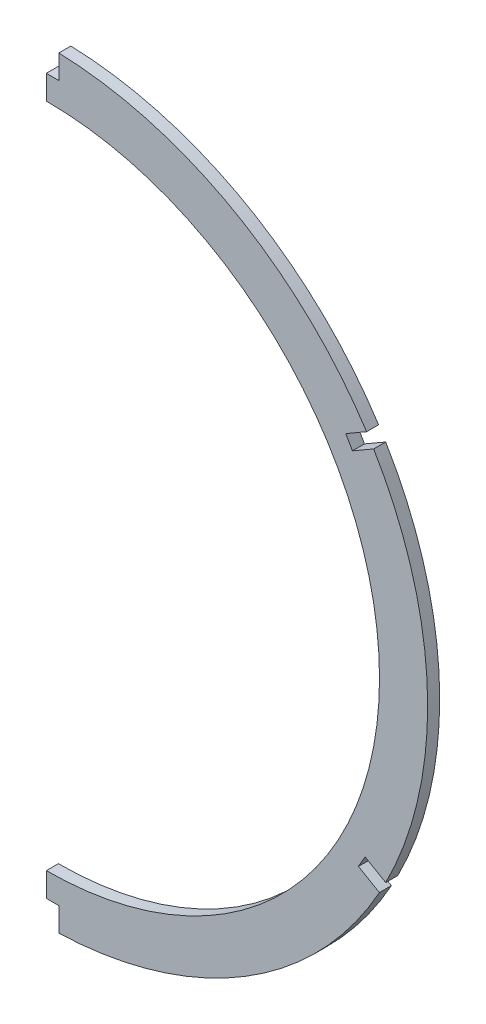
ISO-10303-21;
HEADER;
FILE_DESCRIPTION(('STEP AP214'),'2;1');
FILE_NAME('part.step','',(''),(''),'','','');
FILE_SCHEMA(('AUTOMOTIVE_DESIGN { 1 0 10303 214 1 1 1 1 }'));
ENDSEC;
DATA;
#1=APPLICATION_CONTEXT('core data for automotive mechanical design processes');
#2=APPLICATION_PROTOCOL_DEFINITION('international standard','automotive_design',2000,#1);
#3=PRODUCT_CONTEXT('',#1,'mechanical');
#4=PRODUCT('Part','Part','',(#3));
#5=PRODUCT_RELATED_PRODUCT_CATEGORY('part','',(#4));
#6=PRODUCT_DEFINITION_FORMATION('','',#4);
#7=PRODUCT_DEFINITION_CONTEXT('part definition',#1,'design');
#8=PRODUCT_DEFINITION('design','',#6,#7);
#9=PRODUCT_DEFINITION_SHAPE('','',#8);
#10=(LENGTH_UNIT() NAMED_UNIT(*) SI_UNIT(.MILLI.,.METRE.));
#11=(NAMED_UNIT(*) PLANE_ANGLE_UNIT() SI_UNIT($,.RADIAN.));
#12=(NAMED_UNIT(*) SI_UNIT($,.STERADIAN.) SOLID_ANGLE_UNIT());
#13=UNCERTAINTY_MEASURE_WITH_UNIT(LENGTH_MEASURE(1.E-05),#10,'distance_accuracy_value','');
#14=(GEOMETRIC_REPRESENTATION_CONTEXT(3) GLOBAL_UNCERTAINTY_ASSIGNED_CONTEXT((#13)) GLOBAL_UNIT_ASSIGNED_CONTEXT((#10,
#11,#12)) REPRESENTATION_CONTEXT('',''));
#15=CARTESIAN_POINT('',(0.,0.,0.));
#16=DIRECTION('',(0.,0.,1.));
#17=DIRECTION('',(1.,0.,0.));
#18=AXIS2_PLACEMENT_3D('',#15,#16,#17);
#19=CARTESIAN_POINT('',(0.,6.07817424837746,-3.175));
#20=DIRECTION('',(0.,0.,1.));
#21=DIRECTION('',(1.,0.,0.));
#22=AXIS2_PLACEMENT_3D('',#19,#20,#21);
#23=CYLINDRICAL_SURFACE('',#22,100.601825751622);
#24=CARTESIAN_POINT('',(0.,6.07817424837746,-3.175));
#25=DIRECTION('',(0.,0.,1.));
#26=DIRECTION('',(1.,0.,0.));
#27=AXIS2_PLACEMENT_3D('',#24,#25,#26);
#28=CIRCLE('',#27,100.601825751622);
#29=CARTESIAN_POINT('',(84.490367240827,60.6868291308226,-3.175));
#30=VERTEX_POINT('',#29);
#31=CARTESIAN_POINT('',(3.302,106.625795505968,-3.175));
#32=VERTEX_POINT('',#31);
#33=EDGE_CURVE('E255',#30,#32,#28,.T.);
#34=ORIENTED_EDGE('',*,*,#33,.T.);
#35=DIRECTION('',(0.,0.,1.));
#36=VECTOR('',#35,1.);
#37=CARTESIAN_POINT('',(3.302,106.625795505968,-3.175));
#38=LINE('',#37,#36);
#39=CARTESIAN_POINT('',(3.302,106.625795505968,0.));
#40=VERTEX_POINT('',#39);
#41=EDGE_CURVE('E154',#32,#40,#38,.T.);
#42=ORIENTED_EDGE('',*,*,#41,.T.);
#43=CARTESIAN_POINT('',(0.,6.07817424837746,0.));
#44=DIRECTION('',(0.,0.,1.));
#45=DIRECTION('',(1.,0.,0.));
#46=AXIS2_PLACEMENT_3D('',#43,#44,#45);
#47=CIRCLE('',#46,100.601825751622);
#48=CARTESIAN_POINT('',(84.490367240827,60.6868291308226,0.));
#49=VERTEX_POINT('',#48);
#50=EDGE_CURVE('E251',#49,#40,#47,.T.);
#51=ORIENTED_EDGE('',*,*,#50,.F.);
#52=DIRECTION('',(0.,0.,1.));
#53=VECTOR('',#52,1.);
#54=CARTESIAN_POINT('',(84.490367240827,60.6868291308226,-3.175));
#55=LINE('',#54,#53);
#56=EDGE_CURVE('E58',#30,#49,#55,.T.);
#57=ORIENTED_EDGE('',*,*,#56,.F.);
#58=EDGE_LOOP('',(#34,#42,#51,#57));
#59=FACE_BOUND('',#58,.T.);
#60=ADVANCED_FACE('F36',(#59),#23,.T.);
#61=CARTESIAN_POINT('',(3.30199999999999,-94.4694470092128,-3.175));
#62=VERTEX_POINT('',#61);
#63=CARTESIAN_POINT('',(87.8721842645062,-42.903522099794,-3.175));
#64=VERTEX_POINT('',#63);
#65=EDGE_CURVE('E259',#62,#64,#28,.T.);
#66=ORIENTED_EDGE('',*,*,#65,.T.);
#67=DIRECTION('',(0.,0.,1.));
#68=VECTOR('',#67,1.);
#69=CARTESIAN_POINT('',(87.8721842645062,-42.903522099794,-3.175));
#70=LINE('',#69,#68);
#71=CARTESIAN_POINT('',(87.8721842645062,-42.903522099794,0.));
#72=VERTEX_POINT('',#71);
#73=EDGE_CURVE('E198',#64,#72,#70,.T.);
#74=ORIENTED_EDGE('',*,*,#73,.T.);
#75=CARTESIAN_POINT('',(3.30199999999999,-94.4694470092128,0.));
#76=VERTEX_POINT('',#75);
#77=EDGE_CURVE('E258',#76,#72,#47,.T.);
#78=ORIENTED_EDGE('',*,*,#77,.F.);
#79=DIRECTION('',(0.,0.,1.));
#80=VECTOR('',#79,1.);
#81=CARTESIAN_POINT('',(3.30199999999999,-94.4694470092128,-3.175));
#82=LINE('',#81,#80);
#83=EDGE_CURVE('E192',#62,#76,#82,.T.);
#84=ORIENTED_EDGE('',*,*,#83,.F.);
#85=EDGE_LOOP('',(#66,#74,#78,#84));
#86=FACE_BOUND('',#85,.T.);
#87=ADVANCED_FACE('F294',(#86),#23,.T.);
#88=DIRECTION('',(0.,0.,1.));
#89=VECTOR('',#88,1.);
#90=CARTESIAN_POINT('',(89.5376660151082,-39.7883027160326,-3.175));
#91=LINE('',#90,#89);
#92=CARTESIAN_POINT('',(89.5376660151082,-39.7883027160326,-3.175));
#93=VERTEX_POINT('',#92);
#94=CARTESIAN_POINT('',(89.5376660151082,-39.7883027160326,0.));
#95=VERTEX_POINT('',#94);
#96=EDGE_CURVE('E178',#93,#95,#91,.T.);
#97=ORIENTED_EDGE('',*,*,#96,.F.);
#98=CARTESIAN_POINT('',(86.3554854902251,57.6868699333813,-3.175));
#99=VERTEX_POINT('',#98);
#100=EDGE_CURVE('E257',#93,#99,#28,.T.);
#101=ORIENTED_EDGE('',*,*,#100,.T.);
#102=DIRECTION('',(0.,0.,1.));
#103=VECTOR('',#102,1.);
#104=CARTESIAN_POINT('',(86.3554854902251,57.6868699333813,-3.175));
#105=LINE('',#104,#103);
#106=CARTESIAN_POINT('',(86.3554854902251,57.6868699333813,0.));
#107=VERTEX_POINT('',#106);
#108=EDGE_CURVE('E214',#99,#107,#105,.T.);
#109=ORIENTED_EDGE('',*,*,#108,.T.);
#110=EDGE_CURVE('E261',#95,#107,#47,.T.);
#111=ORIENTED_EDGE('',*,*,#110,.F.);
#112=EDGE_LOOP('',(#97,#101,#109,#111));
#113=FACE_BOUND('',#112,.T.);
#114=ADVANCED_FACE('F275',(#113),#23,.T.);
#115=CARTESIAN_POINT('',(0.,6.07817424837746,-3.175));
#116=DIRECTION('',(0.,0.,1.));
#117=DIRECTION('',(1.,0.,0.));
#118=AXIS2_PLACEMENT_3D('',#115,#116,#117);
#119=PLANE('',#118);
#120=DIRECTION('',(0.,-1.,0.));
#121=VECTOR('',#120,1.);
#122=CARTESIAN_POINT('',(3.30199999999999,0.,-3.175));
#123=LINE('',#122,#121);
#124=CARTESIAN_POINT('',(3.302,100.33,-3.175));
#125=VERTEX_POINT('',#124);
#126=EDGE_CURVE('E148',#32,#125,#123,.T.);
#127=ORIENTED_EDGE('',*,*,#126,.F.);
#128=ORIENTED_EDGE('',*,*,#33,.F.);
#129=DIRECTION('',(-0.866025403784438,-0.500000000000002,0.));
#130=VECTOR('',#129,1.);
#131=CARTESIAN_POINT('',(-5.15557604100213,8.92971964530046,-3.175));
#132=LINE('',#131,#130);
#133=CARTESIAN_POINT('',(78.9965623707427,57.5149794102042,-3.175));
#134=VERTEX_POINT('',#133);
#135=EDGE_CURVE('E221',#30,#134,#132,.T.);
#136=ORIENTED_EDGE('',*,*,#135,.T.);
#137=DIRECTION('',(-0.500000000000001,0.866025403784438,0.));
#138=VECTOR('',#137,1.);
#139=CARTESIAN_POINT('',(84.1521384117448,48.5852597649037,-3.175));
#140=LINE('',#139,#138);
#141=CARTESIAN_POINT('',(80.7618623707427,54.4573901196029,-3.175));
#142=VERTEX_POINT('',#141);
#143=EDGE_CURVE('E224',#142,#134,#140,.T.);
#144=ORIENTED_EDGE('',*,*,#143,.F.);
#145=DIRECTION('',(-0.866025403784439,-0.499999999999999,0.));
#146=VECTOR('',#145,1.);
#147=CARTESIAN_POINT('',(-3.39027604100226,5.87213035469939,-3.175));
#148=LINE('',#147,#146);
#149=EDGE_CURVE('E227',#99,#142,#148,.T.);
#150=ORIENTED_EDGE('',*,*,#149,.F.);
#151=ORIENTED_EDGE('',*,*,#100,.F.);
#152=DIRECTION('',(-0.866025403784437,0.500000000000003,0.));
#153=VECTOR('',#152,1.);
#154=CARTESIAN_POINT('',(5.15557604100242,8.92971964530094,-3.175));
#155=LINE('',#154,#153);
#156=CARTESIAN_POINT('',(84.095044829811,-36.6460039096041,-3.175));
#157=VERTEX_POINT('',#156);
#158=EDGE_CURVE('E180',#93,#157,#155,.T.);
#159=ORIENTED_EDGE('',*,*,#158,.T.);
#160=DIRECTION('',(-0.5,-0.866025403784439,0.));
#161=VECTOR('',#160,1.);
#162=CARTESIAN_POINT('',(78.9394687888088,-45.5757235549047,-3.175));
#163=LINE('',#162,#161);
#164=CARTESIAN_POINT('',(82.3297448298109,-39.7035932002055,-3.175));
#165=VERTEX_POINT('',#164);
#166=EDGE_CURVE('E183',#157,#165,#163,.T.);
#167=ORIENTED_EDGE('',*,*,#166,.T.);
#168=DIRECTION('',(-0.86602540378444,0.499999999999997,0.));
#169=VECTOR('',#168,1.);
#170=CARTESIAN_POINT('',(3.39027604100204,5.87213035469904,-3.175));
#171=LINE('',#170,#169);
#172=EDGE_CURVE('E187',#64,#165,#171,.T.);
#173=ORIENTED_EDGE('',*,*,#172,.F.);
#174=ORIENTED_EDGE('',*,*,#65,.F.);
#175=DIRECTION('',(0.,-1.,0.));
#176=VECTOR('',#175,1.);
#177=CARTESIAN_POINT('',(3.302,0.,-3.175));
#178=LINE('',#177,#176);
#179=CARTESIAN_POINT('',(3.30199999999999,-88.1736515032451,-3.175));
#180=VERTEX_POINT('',#179);
#181=EDGE_CURVE('E204',#180,#62,#178,.T.);
#182=ORIENTED_EDGE('',*,*,#181,.F.);
#183=DIRECTION('',(-1.,0.,0.));
#184=VECTOR('',#183,1.);
#185=CARTESIAN_POINT('',(0.,-88.1736515032451,-3.175));
#186=LINE('',#185,#184);
#187=CARTESIAN_POINT('',(0.,-88.1736515032451,-3.175));
#188=VERTEX_POINT('',#187);
#189=EDGE_CURVE('E206',#180,#188,#186,.T.);
#190=ORIENTED_EDGE('',*,*,#189,.T.);
#191=DIRECTION('',(0.,1.,0.));
#192=VECTOR('',#191,1.);
#193=CARTESIAN_POINT('',(0.,6.07817424837746,-3.175));
#194=LINE('',#193,#192);
#195=CARTESIAN_POINT('',(0.,-81.8236515032451,-3.175));
#196=VERTEX_POINT('',#195);
#197=EDGE_CURVE('E246',#188,#196,#194,.T.);
#198=ORIENTED_EDGE('',*,*,#197,.T.);
#199=CARTESIAN_POINT('',(0.,6.07817424837746,-3.175));
#200=DIRECTION('',(0.,0.,1.));
#201=DIRECTION('',(1.,0.,0.));
#202=AXIS2_PLACEMENT_3D('',#199,#200,#201);
#203=CIRCLE('',#202,87.9018257516225);
#204=CARTESIAN_POINT('',(0.,93.98,-3.175));
#205=VERTEX_POINT('',#204);
#206=EDGE_CURVE('E249',#196,#205,#203,.T.);
#207=ORIENTED_EDGE('',*,*,#206,.T.);
#208=CARTESIAN_POINT('',(0.,100.33,-3.175));
#209=VERTEX_POINT('',#208);
#210=EDGE_CURVE('E172',#205,#209,#194,.T.);
#211=ORIENTED_EDGE('',*,*,#210,.T.);
#212=DIRECTION('',(1.,0.,0.));
#213=VECTOR('',#212,1.);
#214=CARTESIAN_POINT('',(0.,100.33,-3.175));
#215=LINE('',#214,#213);
#216=EDGE_CURVE('E159',#209,#125,#215,.T.);
#217=ORIENTED_EDGE('',*,*,#216,.T.);
#218=EDGE_LOOP('',(#127,#128,#136,#144,#150,#151,#159,#167,#173,#174,#182,#190,#198,#207,#211,#217));
#219=FACE_BOUND('',#218,.T.);
#220=ADVANCED_FACE('F170',(#219),#119,.F.);
#221=CARTESIAN_POINT('',(0.,6.07817424837746,0.));
#222=DIRECTION('',(0.,0.,1.));
#223=DIRECTION('',(1.,0.,0.));
#224=AXIS2_PLACEMENT_3D('',#221,#222,#223);
#225=PLANE('',#224);
#226=ORIENTED_EDGE('',*,*,#50,.T.);
#227=DIRECTION('',(0.,-1.,0.));
#228=VECTOR('',#227,1.);
#229=CARTESIAN_POINT('',(3.30199999999999,0.,0.));
#230=LINE('',#229,#228);
#231=CARTESIAN_POINT('',(3.302,100.33,0.));
#232=VERTEX_POINT('',#231);
#233=EDGE_CURVE('E176',#40,#232,#230,.T.);
#234=ORIENTED_EDGE('',*,*,#233,.T.);
#235=DIRECTION('',(1.,0.,0.));
#236=VECTOR('',#235,1.);
#237=CARTESIAN_POINT('',(0.,100.33,0.));
#238=LINE('',#237,#236);
#239=CARTESIAN_POINT('',(0.,100.33,0.));
#240=VERTEX_POINT('',#239);
#241=EDGE_CURVE('E160',#240,#232,#238,.T.);
#242=ORIENTED_EDGE('',*,*,#241,.F.);
#243=DIRECTION('',(0.,1.,0.));
#244=VECTOR('',#243,1.);
#245=CARTESIAN_POINT('',(0.,6.07817424837746,0.));
#246=LINE('',#245,#244);
#247=CARTESIAN_POINT('',(0.,93.98,0.));
#248=VERTEX_POINT('',#247);
#249=EDGE_CURVE('E247',#248,#240,#246,.T.);
#250=ORIENTED_EDGE('',*,*,#249,.F.);
#251=CARTESIAN_POINT('',(0.,6.07817424837746,0.));
#252=DIRECTION('',(0.,0.,1.));
#253=DIRECTION('',(1.,0.,0.));
#254=AXIS2_PLACEMENT_3D('',#251,#252,#253);
#255=CIRCLE('',#254,87.9018257516225);
#256=CARTESIAN_POINT('',(0.,-81.8236515032451,0.));
#257=VERTEX_POINT('',#256);
#258=EDGE_CURVE('E252',#257,#248,#255,.T.);
#259=ORIENTED_EDGE('',*,*,#258,.F.);
#260=CARTESIAN_POINT('',(0.,-88.1736515032451,0.));
#261=VERTEX_POINT('',#260);
#262=EDGE_CURVE('E244',#261,#257,#246,.T.);
#263=ORIENTED_EDGE('',*,*,#262,.F.);
#264=DIRECTION('',(-1.,0.,0.));
#265=VECTOR('',#264,1.);
#266=CARTESIAN_POINT('',(0.,-88.1736515032451,0.));
#267=LINE('',#266,#265);
#268=CARTESIAN_POINT('',(3.30199999999999,-88.1736515032451,0.));
#269=VERTEX_POINT('',#268);
#270=EDGE_CURVE('E207',#269,#261,#267,.T.);
#271=ORIENTED_EDGE('',*,*,#270,.F.);
#272=DIRECTION('',(0.,-1.,0.));
#273=VECTOR('',#272,1.);
#274=CARTESIAN_POINT('',(3.302,0.,0.));
#275=LINE('',#274,#273);
#276=EDGE_CURVE('E211',#269,#76,#275,.T.);
#277=ORIENTED_EDGE('',*,*,#276,.T.);
#278=ORIENTED_EDGE('',*,*,#77,.T.);
#279=DIRECTION('',(-0.86602540378444,0.499999999999997,0.));
#280=VECTOR('',#279,1.);
#281=CARTESIAN_POINT('',(3.39027604100204,5.87213035469904,0.));
#282=LINE('',#281,#280);
#283=CARTESIAN_POINT('',(82.3297448298109,-39.7035932002055,0.));
#284=VERTEX_POINT('',#283);
#285=EDGE_CURVE('E184',#72,#284,#282,.T.);
#286=ORIENTED_EDGE('',*,*,#285,.T.);
#287=DIRECTION('',(-0.5,-0.866025403784439,0.));
#288=VECTOR('',#287,1.);
#289=CARTESIAN_POINT('',(78.9394687888088,-45.5757235549047,0.));
#290=LINE('',#289,#288);
#291=CARTESIAN_POINT('',(84.095044829811,-36.6460039096041,0.));
#292=VERTEX_POINT('',#291);
#293=EDGE_CURVE('E191',#292,#284,#290,.T.);
#294=ORIENTED_EDGE('',*,*,#293,.F.);
#295=DIRECTION('',(-0.866025403784437,0.500000000000003,0.));
#296=VECTOR('',#295,1.);
#297=CARTESIAN_POINT('',(5.15557604100242,8.92971964530094,0.));
#298=LINE('',#297,#296);
#299=EDGE_CURVE('E50',#95,#292,#298,.T.);
#300=ORIENTED_EDGE('',*,*,#299,.F.);
#301=ORIENTED_EDGE('',*,*,#110,.T.);
#302=DIRECTION('',(-0.866025403784439,-0.499999999999999,0.));
#303=VECTOR('',#302,1.);
#304=CARTESIAN_POINT('',(-3.39027604100226,5.87213035469939,0.));
#305=LINE('',#304,#303);
#306=CARTESIAN_POINT('',(80.7618623707427,54.4573901196029,0.));
#307=VERTEX_POINT('',#306);
#308=EDGE_CURVE('E225',#107,#307,#305,.T.);
#309=ORIENTED_EDGE('',*,*,#308,.T.);
#310=DIRECTION('',(-0.500000000000001,0.866025403784438,0.));
#311=VECTOR('',#310,1.);
#312=CARTESIAN_POINT('',(84.1521384117448,48.5852597649037,0.));
#313=LINE('',#312,#311);
#314=CARTESIAN_POINT('',(78.9965623707427,57.5149794102042,0.));
#315=VERTEX_POINT('',#314);
#316=EDGE_CURVE('E231',#307,#315,#313,.T.);
#317=ORIENTED_EDGE('',*,*,#316,.T.);
#318=DIRECTION('',(-0.866025403784438,-0.500000000000002,0.));
#319=VECTOR('',#318,1.);
#320=CARTESIAN_POINT('',(-5.15557604100213,8.92971964530046,0.));
#321=LINE('',#320,#319);
#322=EDGE_CURVE('E229',#49,#315,#321,.T.);
#323=ORIENTED_EDGE('',*,*,#322,.F.);
#324=EDGE_LOOP('',(#226,#234,#242,#250,#259,#263,#271,#277,#278,#286,#294,#300,#301,#309,#317,#323));
#325=FACE_BOUND('',#324,.T.);
#326=ADVANCED_FACE('F288',(#325),#225,.T.);
#327=CARTESIAN_POINT('',(0.,6.07817424837746,-3.175));
#328=DIRECTION('',(0.,0.,1.));
#329=DIRECTION('',(1.,0.,0.));
#330=AXIS2_PLACEMENT_3D('',#327,#328,#329);
#331=CYLINDRICAL_SURFACE('',#330,87.9018257516225);
#332=ORIENTED_EDGE('',*,*,#258,.T.);
#333=DIRECTION('',(0.,0.,1.));
#334=VECTOR('',#333,1.);
#335=CARTESIAN_POINT('',(0.,93.98,-3.175));
#336=LINE('',#335,#334);
#337=EDGE_CURVE('E11',#248,#205,#336,.F.);
#338=ORIENTED_EDGE('',*,*,#337,.T.);
#339=ORIENTED_EDGE('',*,*,#206,.F.);
#340=DIRECTION('',(0.,0.,1.));
#341=VECTOR('',#340,1.);
#342=CARTESIAN_POINT('',(0.,-81.8236515032451,-3.175));
#343=LINE('',#342,#341);
#344=EDGE_CURVE('E43',#196,#257,#343,.T.);
#345=ORIENTED_EDGE('',*,*,#344,.T.);
#346=EDGE_LOOP('',(#332,#338,#339,#345));
#347=FACE_BOUND('',#346,.T.);
#348=ADVANCED_FACE('F328',(#347),#331,.F.);
#349=CARTESIAN_POINT('',(0.,0.,0.));
#350=DIRECTION('',(1.,0.,0.));
#351=DIRECTION('',(0.,0.,-1.));
#352=AXIS2_PLACEMENT_3D('',#349,#350,#351);
#353=PLANE('',#352);
#354=ORIENTED_EDGE('',*,*,#197,.F.);
#355=DIRECTION('',(0.,0.,1.));
#356=VECTOR('',#355,1.);
#357=CARTESIAN_POINT('',(0.,-88.1736515032451,-3.175));
#358=LINE('',#357,#356);
#359=EDGE_CURVE('E217',#188,#261,#358,.T.);
#360=ORIENTED_EDGE('',*,*,#359,.T.);
#361=ORIENTED_EDGE('',*,*,#262,.T.);
#362=ORIENTED_EDGE('',*,*,#344,.F.);
#363=EDGE_LOOP('',(#354,#360,#361,#362));
#364=FACE_BOUND('',#363,.T.);
#365=ADVANCED_FACE('F332',(#364),#353,.F.);
#366=ORIENTED_EDGE('',*,*,#249,.T.);
#367=DIRECTION('',(0.,0.,1.));
#368=VECTOR('',#367,1.);
#369=CARTESIAN_POINT('',(0.,100.33,-3.175));
#370=LINE('',#369,#368);
#371=EDGE_CURVE('E167',#209,#240,#370,.T.);
#372=ORIENTED_EDGE('',*,*,#371,.F.);
#373=ORIENTED_EDGE('',*,*,#210,.F.);
#374=ORIENTED_EDGE('',*,*,#337,.F.);
#375=EDGE_LOOP('',(#366,#372,#373,#374));
#376=FACE_BOUND('',#375,.T.);
#377=ADVANCED_FACE('F334',(#376),#353,.F.);
#378=CARTESIAN_POINT('',(3.30199999999999,0.,-3.175));
#379=DIRECTION('',(-1.,0.,0.));
#380=DIRECTION('',(0.,-1.,0.));
#381=AXIS2_PLACEMENT_3D('',#378,#379,#380);
#382=PLANE('',#381);
#383=ORIENTED_EDGE('',*,*,#126,.T.);
#384=DIRECTION('',(0.,0.,1.));
#385=VECTOR('',#384,1.);
#386=CARTESIAN_POINT('',(3.302,100.33,-3.175));
#387=LINE('',#386,#385);
#388=EDGE_CURVE('E151',#125,#232,#387,.T.);
#389=ORIENTED_EDGE('',*,*,#388,.T.);
#390=ORIENTED_EDGE('',*,*,#233,.F.);
#391=ORIENTED_EDGE('',*,*,#41,.F.);
#392=EDGE_LOOP('',(#383,#389,#390,#391));
#393=FACE_BOUND('',#392,.T.);
#394=ADVANCED_FACE('F150',(#393),#382,.T.);
#395=CARTESIAN_POINT('',(0.,100.33,-3.175));
#396=DIRECTION('',(0.,-1.,0.));
#397=DIRECTION('',(0.,0.,-1.));
#398=AXIS2_PLACEMENT_3D('',#395,#396,#397);
#399=PLANE('',#398);
#400=ORIENTED_EDGE('',*,*,#241,.T.);
#401=ORIENTED_EDGE('',*,*,#388,.F.);
#402=ORIENTED_EDGE('',*,*,#216,.F.);
#403=ORIENTED_EDGE('',*,*,#371,.T.);
#404=EDGE_LOOP('',(#400,#401,#402,#403));
#405=FACE_BOUND('',#404,.T.);
#406=ADVANCED_FACE('F163',(#405),#399,.F.);
#407=CARTESIAN_POINT('',(3.302,0.,-3.175));
#408=DIRECTION('',(-1.,0.,0.));
#409=DIRECTION('',(0.,-1.,0.));
#410=AXIS2_PLACEMENT_3D('',#407,#408,#409);
#411=PLANE('',#410);
#412=ORIENTED_EDGE('',*,*,#276,.F.);
#413=DIRECTION('',(0.,0.,1.));
#414=VECTOR('',#413,1.);
#415=CARTESIAN_POINT('',(3.30199999999999,-88.1736515032451,-3.175));
#416=LINE('',#415,#414);
#417=EDGE_CURVE('E210',#180,#269,#416,.T.);
#418=ORIENTED_EDGE('',*,*,#417,.F.);
#419=ORIENTED_EDGE('',*,*,#181,.T.);
#420=ORIENTED_EDGE('',*,*,#83,.T.);
#421=EDGE_LOOP('',(#412,#418,#419,#420));
#422=FACE_BOUND('',#421,.T.);
#423=ADVANCED_FACE('F342',(#422),#411,.T.);
#424=CARTESIAN_POINT('',(0.,-88.1736515032451,-3.175));
#425=DIRECTION('',(0.,1.,0.));
#426=DIRECTION('',(0.,0.,1.));
#427=AXIS2_PLACEMENT_3D('',#424,#425,#426);
#428=PLANE('',#427);
#429=ORIENTED_EDGE('',*,*,#270,.T.);
#430=ORIENTED_EDGE('',*,*,#359,.F.);
#431=ORIENTED_EDGE('',*,*,#189,.F.);
#432=ORIENTED_EDGE('',*,*,#417,.T.);
#433=EDGE_LOOP('',(#429,#430,#431,#432));
#434=FACE_BOUND('',#433,.T.);
#435=ADVANCED_FACE('F341',(#434),#428,.F.);
#436=CARTESIAN_POINT('',(-3.39027604100226,5.87213035469939,-3.175));
#437=DIRECTION('',(-0.499999999999999,0.866025403784439,0.));
#438=DIRECTION('',(-0.866025403784439,-0.499999999999999,0.));
#439=AXIS2_PLACEMENT_3D('',#436,#437,#438);
#440=PLANE('',#439);
#441=ORIENTED_EDGE('',*,*,#308,.F.);
#442=ORIENTED_EDGE('',*,*,#108,.F.);
#443=ORIENTED_EDGE('',*,*,#149,.T.);
#444=DIRECTION('',(0.,0.,1.));
#445=VECTOR('',#444,1.);
#446=CARTESIAN_POINT('',(80.7618623707427,54.4573901196029,-3.175));
#447=LINE('',#446,#445);
#448=EDGE_CURVE('E238',#142,#307,#447,.T.);
#449=ORIENTED_EDGE('',*,*,#448,.T.);
#450=EDGE_LOOP('',(#441,#442,#443,#449));
#451=FACE_BOUND('',#450,.T.);
#452=ADVANCED_FACE('F282',(#451),#440,.T.);
#453=CARTESIAN_POINT('',(84.1521384117448,48.5852597649037,-3.175));
#454=DIRECTION('',(0.866025403784438,0.500000000000001,0.));
#455=DIRECTION('',(-0.500000000000001,0.866025403784438,0.));
#456=AXIS2_PLACEMENT_3D('',#453,#454,#455);
#457=PLANE('',#456);
#458=ORIENTED_EDGE('',*,*,#316,.F.);
#459=ORIENTED_EDGE('',*,*,#448,.F.);
#460=ORIENTED_EDGE('',*,*,#143,.T.);
#461=DIRECTION('',(0.,0.,1.));
#462=VECTOR('',#461,1.);
#463=CARTESIAN_POINT('',(78.9965623707427,57.5149794102042,-3.175));
#464=LINE('',#463,#462);
#465=EDGE_CURVE('E240',#134,#315,#464,.T.);
#466=ORIENTED_EDGE('',*,*,#465,.T.);
#467=EDGE_LOOP('',(#458,#459,#460,#466));
#468=FACE_BOUND('',#467,.T.);
#469=ADVANCED_FACE('F285',(#468),#457,.T.);
#470=CARTESIAN_POINT('',(-5.15557604100213,8.92971964530046,-3.175));
#471=DIRECTION('',(-0.500000000000002,0.866025403784438,0.));
#472=DIRECTION('',(-0.866025403784438,-0.500000000000002,0.));
#473=AXIS2_PLACEMENT_3D('',#470,#471,#472);
#474=PLANE('',#473);
#475=ORIENTED_EDGE('',*,*,#322,.T.);
#476=ORIENTED_EDGE('',*,*,#465,.F.);
#477=ORIENTED_EDGE('',*,*,#135,.F.);
#478=ORIENTED_EDGE('',*,*,#56,.T.);
#479=EDGE_LOOP('',(#475,#476,#477,#478));
#480=FACE_BOUND('',#479,.T.);
#481=ADVANCED_FACE('F305',(#480),#474,.F.);
#482=CARTESIAN_POINT('',(5.15557604100242,8.92971964530094,-3.175));
#483=DIRECTION('',(0.500000000000003,0.866025403784437,0.));
#484=DIRECTION('',(-0.866025403784437,0.500000000000003,0.));
#485=AXIS2_PLACEMENT_3D('',#482,#483,#484);
#486=PLANE('',#485);
#487=ORIENTED_EDGE('',*,*,#299,.T.);
#488=DIRECTION('',(0.,0.,1.));
#489=VECTOR('',#488,1.);
#490=CARTESIAN_POINT('',(84.095044829811,-36.6460039096041,-3.175));
#491=LINE('',#490,#489);
#492=EDGE_CURVE('E189',#157,#292,#491,.T.);
#493=ORIENTED_EDGE('',*,*,#492,.F.);
#494=ORIENTED_EDGE('',*,*,#158,.F.);
#495=ORIENTED_EDGE('',*,*,#96,.T.);
#496=EDGE_LOOP('',(#487,#493,#494,#495));
#497=FACE_BOUND('',#496,.T.);
#498=ADVANCED_FACE('F303',(#497),#486,.F.);
#499=CARTESIAN_POINT('',(3.39027604100204,5.87213035469904,-3.175));
#500=DIRECTION('',(0.499999999999997,0.86602540378444,0.));
#501=DIRECTION('',(-0.866025403784441,0.499999999999997,0.));
#502=AXIS2_PLACEMENT_3D('',#499,#500,#501);
#503=PLANE('',#502);
#504=ORIENTED_EDGE('',*,*,#285,.F.);
#505=ORIENTED_EDGE('',*,*,#73,.F.);
#506=ORIENTED_EDGE('',*,*,#172,.T.);
#507=DIRECTION('',(0.,0.,1.));
#508=VECTOR('',#507,1.);
#509=CARTESIAN_POINT('',(82.3297448298109,-39.7035932002055,-3.175));
#510=LINE('',#509,#508);
#511=EDGE_CURVE('E201',#165,#284,#510,.T.);
#512=ORIENTED_EDGE('',*,*,#511,.T.);
#513=EDGE_LOOP('',(#504,#505,#506,#512));
#514=FACE_BOUND('',#513,.T.);
#515=ADVANCED_FACE('F297',(#514),#503,.T.);
#516=CARTESIAN_POINT('',(78.9394687888088,-45.5757235549047,-3.175));
#517=DIRECTION('',(-0.866025403784439,0.5,0.));
#518=DIRECTION('',(-0.5,-0.866025403784439,0.));
#519=AXIS2_PLACEMENT_3D('',#516,#517,#518);
#520=PLANE('',#519);
#521=ORIENTED_EDGE('',*,*,#293,.T.);
#522=ORIENTED_EDGE('',*,*,#511,.F.);
#523=ORIENTED_EDGE('',*,*,#166,.F.);
#524=ORIENTED_EDGE('',*,*,#492,.T.);
#525=EDGE_LOOP('',(#521,#522,#523,#524));
#526=FACE_BOUND('',#525,.T.);
#527=ADVANCED_FACE('F302',(#526),#520,.F.);
#528=CLOSED_SHELL('',(#60,#87,#114,#220,#326,#348,#365,#377,#394,#406,#423,#435,#452,#469,#481,
#498,#515,#527));
#529=MANIFOLD_SOLID_BREP('B2',#528);
#530=ADVANCED_BREP_SHAPE_REPRESENTATION('',(#18,#529),#14);
#531=SHAPE_DEFINITION_REPRESENTATION(#9,#530);
ENDSEC;
END-ISO-10303-21;
